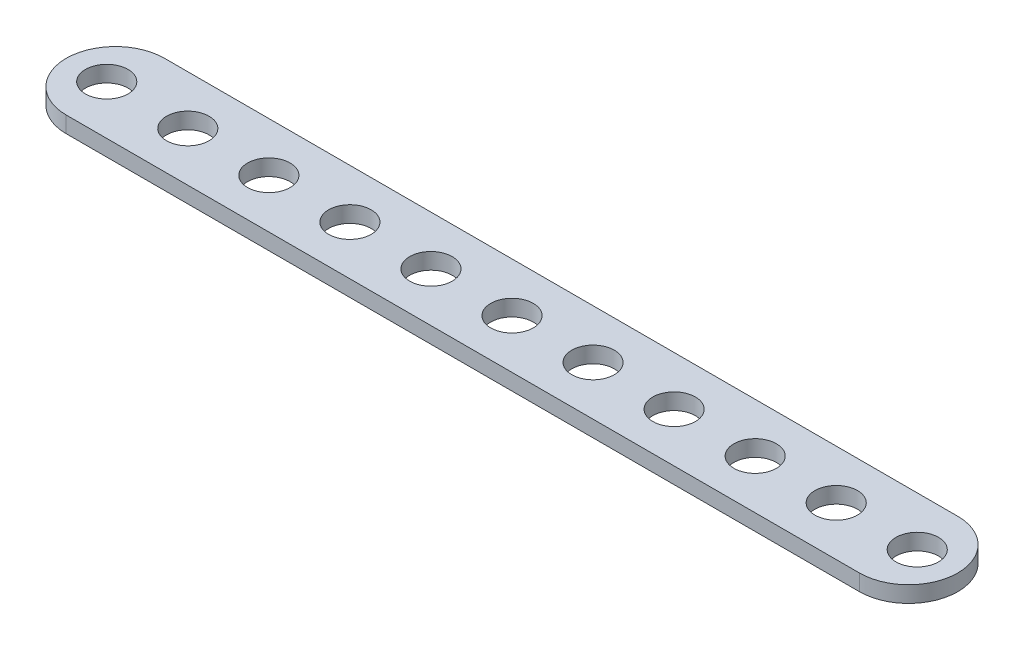
ISO-10303-21;
HEADER;
FILE_DESCRIPTION(('STEP AP214'),'2;1');
FILE_NAME('part.step','',(''),(''),'','','');
FILE_SCHEMA(('AUTOMOTIVE_DESIGN { 1 0 10303 214 1 1 1 1 }'));
ENDSEC;
DATA;
#1=APPLICATION_CONTEXT('core data for automotive mechanical design processes');
#2=APPLICATION_PROTOCOL_DEFINITION('international standard','automotive_design',2000,#1);
#3=PRODUCT_CONTEXT('',#1,'mechanical');
#4=PRODUCT('Part','Part','',(#3));
#5=PRODUCT_RELATED_PRODUCT_CATEGORY('part','',(#4));
#6=PRODUCT_DEFINITION_FORMATION('','',#4);
#7=PRODUCT_DEFINITION_CONTEXT('part definition',#1,'design');
#8=PRODUCT_DEFINITION('design','',#6,#7);
#9=PRODUCT_DEFINITION_SHAPE('','',#8);
#10=(LENGTH_UNIT() NAMED_UNIT(*) SI_UNIT(.MILLI.,.METRE.));
#11=(NAMED_UNIT(*) PLANE_ANGLE_UNIT() SI_UNIT($,.RADIAN.));
#12=(NAMED_UNIT(*) SI_UNIT($,.STERADIAN.) SOLID_ANGLE_UNIT());
#13=UNCERTAINTY_MEASURE_WITH_UNIT(LENGTH_MEASURE(1.E-05),#10,'distance_accuracy_value','');
#14=(GEOMETRIC_REPRESENTATION_CONTEXT(3) GLOBAL_UNCERTAINTY_ASSIGNED_CONTEXT((#13)) GLOBAL_UNIT_ASSIGNED_CONTEXT((#10,
#11,#12)) REPRESENTATION_CONTEXT('',''));
#15=CARTESIAN_POINT('',(0.,0.,0.));
#16=DIRECTION('',(0.,0.,1.));
#17=DIRECTION('',(1.,0.,0.));
#18=AXIS2_PLACEMENT_3D('',#15,#16,#17);
#19=CARTESIAN_POINT('',(4.85,1.6,0.));
#20=DIRECTION('',(0.,-1.,0.));
#21=DIRECTION('',(0.,0.,-1.));
#22=AXIS2_PLACEMENT_3D('',#19,#20,#21);
#23=CYLINDRICAL_SURFACE('',#22,4.85);
#24=CARTESIAN_POINT('',(4.85,0.,0.));
#25=DIRECTION('',(0.,1.,0.));
#26=DIRECTION('',(0.,0.,1.));
#27=AXIS2_PLACEMENT_3D('',#24,#25,#26);
#28=CIRCLE('',#27,4.85);
#29=CARTESIAN_POINT('',(4.85,0.,-4.85));
#30=VERTEX_POINT('',#29);
#31=CARTESIAN_POINT('',(4.85,0.,4.85));
#32=VERTEX_POINT('',#31);
#33=EDGE_CURVE('E95',#30,#32,#28,.T.);
#34=ORIENTED_EDGE('',*,*,#33,.T.);
#35=DIRECTION('',(0.,-1.,0.));
#36=VECTOR('',#35,1.);
#37=CARTESIAN_POINT('',(4.85,1.6,4.85));
#38=LINE('',#37,#36);
#39=CARTESIAN_POINT('',(4.85,1.6,4.85));
#40=VERTEX_POINT('',#39);
#41=EDGE_CURVE('E11',#40,#32,#38,.T.);
#42=ORIENTED_EDGE('',*,*,#41,.F.);
#43=CARTESIAN_POINT('',(4.85,1.6,0.));
#44=DIRECTION('',(0.,1.,0.));
#45=DIRECTION('',(0.,0.,1.));
#46=AXIS2_PLACEMENT_3D('',#43,#44,#45);
#47=CIRCLE('',#46,4.85);
#48=CARTESIAN_POINT('',(4.85,1.6,-4.85));
#49=VERTEX_POINT('',#48);
#50=EDGE_CURVE('E83',#49,#40,#47,.T.);
#51=ORIENTED_EDGE('',*,*,#50,.F.);
#52=DIRECTION('',(0.,-1.,0.));
#53=VECTOR('',#52,1.);
#54=CARTESIAN_POINT('',(4.85,1.6,-4.85));
#55=LINE('',#54,#53);
#56=EDGE_CURVE('E91',#49,#30,#55,.T.);
#57=ORIENTED_EDGE('',*,*,#56,.T.);
#58=EDGE_LOOP('',(#34,#42,#51,#57));
#59=FACE_BOUND('',#58,.T.);
#60=ADVANCED_FACE('F32',(#59),#23,.T.);
#61=CARTESIAN_POINT('',(4.85,1.6,4.85));
#62=DIRECTION('',(0.,0.,-1.));
#63=DIRECTION('',(-1.,0.,0.));
#64=AXIS2_PLACEMENT_3D('',#61,#62,#63);
#65=PLANE('',#64);
#66=DIRECTION('',(1.,0.,0.));
#67=VECTOR('',#66,1.);
#68=CARTESIAN_POINT('',(4.85,0.,4.85));
#69=LINE('',#68,#67);
#70=CARTESIAN_POINT('',(83.15,0.,4.85));
#71=VERTEX_POINT('',#70);
#72=EDGE_CURVE('E87',#32,#71,#69,.T.);
#73=ORIENTED_EDGE('',*,*,#72,.T.);
#74=DIRECTION('',(0.,-1.,0.));
#75=VECTOR('',#74,1.);
#76=CARTESIAN_POINT('',(83.15,1.6,4.85));
#77=LINE('',#76,#75);
#78=CARTESIAN_POINT('',(83.15,1.6,4.85));
#79=VERTEX_POINT('',#78);
#80=EDGE_CURVE('E40',#79,#71,#77,.T.);
#81=ORIENTED_EDGE('',*,*,#80,.F.);
#82=DIRECTION('',(1.,0.,0.));
#83=VECTOR('',#82,1.);
#84=CARTESIAN_POINT('',(4.85,1.6,4.85));
#85=LINE('',#84,#83);
#86=EDGE_CURVE('E78',#40,#79,#85,.T.);
#87=ORIENTED_EDGE('',*,*,#86,.F.);
#88=ORIENTED_EDGE('',*,*,#41,.T.);
#89=EDGE_LOOP('',(#73,#81,#87,#88));
#90=FACE_BOUND('',#89,.T.);
#91=ADVANCED_FACE('F86',(#90),#65,.F.);
#92=CARTESIAN_POINT('',(83.15,1.6,0.));
#93=DIRECTION('',(0.,-1.,0.));
#94=DIRECTION('',(0.,0.,-1.));
#95=AXIS2_PLACEMENT_3D('',#92,#93,#94);
#96=CYLINDRICAL_SURFACE('',#95,4.85);
#97=CARTESIAN_POINT('',(83.15,0.,0.));
#98=DIRECTION('',(0.,1.,0.));
#99=DIRECTION('',(0.,0.,1.));
#100=AXIS2_PLACEMENT_3D('',#97,#98,#99);
#101=CIRCLE('',#100,4.85);
#102=CARTESIAN_POINT('',(83.15,0.,-4.85));
#103=VERTEX_POINT('',#102);
#104=EDGE_CURVE('E65',#71,#103,#101,.T.);
#105=ORIENTED_EDGE('',*,*,#104,.T.);
#106=DIRECTION('',(0.,-1.,0.));
#107=VECTOR('',#106,1.);
#108=CARTESIAN_POINT('',(83.15,1.6,-4.85));
#109=LINE('',#108,#107);
#110=CARTESIAN_POINT('',(83.15,1.6,-4.85));
#111=VERTEX_POINT('',#110);
#112=EDGE_CURVE('E88',#111,#103,#109,.T.);
#113=ORIENTED_EDGE('',*,*,#112,.F.);
#114=CARTESIAN_POINT('',(83.15,1.6,0.));
#115=DIRECTION('',(0.,1.,0.));
#116=DIRECTION('',(0.,0.,1.));
#117=AXIS2_PLACEMENT_3D('',#114,#115,#116);
#118=CIRCLE('',#117,4.85);
#119=EDGE_CURVE('E81',#79,#111,#118,.T.);
#120=ORIENTED_EDGE('',*,*,#119,.F.);
#121=ORIENTED_EDGE('',*,*,#80,.T.);
#122=EDGE_LOOP('',(#105,#113,#120,#121));
#123=FACE_BOUND('',#122,.T.);
#124=ADVANCED_FACE('F89',(#123),#96,.T.);
#125=CARTESIAN_POINT('',(4.85,1.6,-4.85));
#126=DIRECTION('',(0.,0.,1.));
#127=DIRECTION('',(1.,0.,0.));
#128=AXIS2_PLACEMENT_3D('',#125,#126,#127);
#129=PLANE('',#128);
#130=DIRECTION('',(-1.,0.,0.));
#131=VECTOR('',#130,1.);
#132=CARTESIAN_POINT('',(4.85,0.,-4.85));
#133=LINE('',#132,#131);
#134=EDGE_CURVE('E71',#103,#30,#133,.T.);
#135=ORIENTED_EDGE('',*,*,#134,.T.);
#136=ORIENTED_EDGE('',*,*,#56,.F.);
#137=DIRECTION('',(-1.,0.,0.));
#138=VECTOR('',#137,1.);
#139=CARTESIAN_POINT('',(4.85,1.6,-4.85));
#140=LINE('',#139,#138);
#141=EDGE_CURVE('E48',#111,#49,#140,.T.);
#142=ORIENTED_EDGE('',*,*,#141,.F.);
#143=ORIENTED_EDGE('',*,*,#112,.T.);
#144=EDGE_LOOP('',(#135,#136,#142,#143));
#145=FACE_BOUND('',#144,.T.);
#146=ADVANCED_FACE('F103',(#145),#129,.F.);
#147=CARTESIAN_POINT('',(4.85,1.6,0.));
#148=DIRECTION('',(0.,1.,0.));
#149=DIRECTION('',(0.,0.,1.));
#150=AXIS2_PLACEMENT_3D('',#147,#148,#149);
#151=PLANE('',#150);
#152=CARTESIAN_POINT('',(84.,1.6,0.));
#153=DIRECTION('',(0.,1.,0.));
#154=DIRECTION('',(0.,0.,1.));
#155=AXIS2_PLACEMENT_3D('',#152,#153,#154);
#156=CIRCLE('',#155,2.1);
#157=CARTESIAN_POINT('',(84.,1.6,2.1));
#158=VERTEX_POINT('',#157);
#159=EDGE_CURVE('E169',#158,#158,#156,.T.);
#160=ORIENTED_EDGE('',*,*,#159,.F.);
#161=EDGE_LOOP('',(#160));
#162=FACE_BOUND('',#161,.T.);
#163=CARTESIAN_POINT('',(76.,1.6,0.));
#164=DIRECTION('',(0.,1.,0.));
#165=DIRECTION('',(0.,0.,1.));
#166=AXIS2_PLACEMENT_3D('',#163,#164,#165);
#167=CIRCLE('',#166,2.1);
#168=CARTESIAN_POINT('',(76.,1.6,2.1));
#169=VERTEX_POINT('',#168);
#170=EDGE_CURVE('E163',#169,#169,#167,.T.);
#171=ORIENTED_EDGE('',*,*,#170,.F.);
#172=EDGE_LOOP('',(#171));
#173=FACE_BOUND('',#172,.T.);
#174=CARTESIAN_POINT('',(68.,1.6,0.));
#175=DIRECTION('',(0.,1.,0.));
#176=DIRECTION('',(0.,0.,1.));
#177=AXIS2_PLACEMENT_3D('',#174,#175,#176);
#178=CIRCLE('',#177,2.1);
#179=CARTESIAN_POINT('',(68.,1.6,2.1));
#180=VERTEX_POINT('',#179);
#181=EDGE_CURVE('E157',#180,#180,#178,.T.);
#182=ORIENTED_EDGE('',*,*,#181,.F.);
#183=EDGE_LOOP('',(#182));
#184=FACE_BOUND('',#183,.T.);
#185=CARTESIAN_POINT('',(60.,1.6,0.));
#186=DIRECTION('',(0.,1.,0.));
#187=DIRECTION('',(0.,0.,1.));
#188=AXIS2_PLACEMENT_3D('',#185,#186,#187);
#189=CIRCLE('',#188,2.1);
#190=CARTESIAN_POINT('',(60.,1.6,2.1));
#191=VERTEX_POINT('',#190);
#192=EDGE_CURVE('E151',#191,#191,#189,.T.);
#193=ORIENTED_EDGE('',*,*,#192,.F.);
#194=EDGE_LOOP('',(#193));
#195=FACE_BOUND('',#194,.T.);
#196=CARTESIAN_POINT('',(52.,1.6,0.));
#197=DIRECTION('',(0.,1.,0.));
#198=DIRECTION('',(0.,0.,1.));
#199=AXIS2_PLACEMENT_3D('',#196,#197,#198);
#200=CIRCLE('',#199,2.1);
#201=CARTESIAN_POINT('',(52.,1.6,2.1));
#202=VERTEX_POINT('',#201);
#203=EDGE_CURVE('E145',#202,#202,#200,.T.);
#204=ORIENTED_EDGE('',*,*,#203,.F.);
#205=EDGE_LOOP('',(#204));
#206=FACE_BOUND('',#205,.T.);
#207=CARTESIAN_POINT('',(44.,1.6,0.));
#208=DIRECTION('',(0.,1.,0.));
#209=DIRECTION('',(0.,0.,1.));
#210=AXIS2_PLACEMENT_3D('',#207,#208,#209);
#211=CIRCLE('',#210,2.1);
#212=CARTESIAN_POINT('',(44.,1.6,2.1));
#213=VERTEX_POINT('',#212);
#214=EDGE_CURVE('E139',#213,#213,#211,.T.);
#215=ORIENTED_EDGE('',*,*,#214,.F.);
#216=EDGE_LOOP('',(#215));
#217=FACE_BOUND('',#216,.T.);
#218=CARTESIAN_POINT('',(36.,1.6,0.));
#219=DIRECTION('',(0.,1.,0.));
#220=DIRECTION('',(0.,0.,1.));
#221=AXIS2_PLACEMENT_3D('',#218,#219,#220);
#222=CIRCLE('',#221,2.1);
#223=CARTESIAN_POINT('',(36.,1.6,2.1));
#224=VERTEX_POINT('',#223);
#225=EDGE_CURVE('E133',#224,#224,#222,.T.);
#226=ORIENTED_EDGE('',*,*,#225,.F.);
#227=EDGE_LOOP('',(#226));
#228=FACE_BOUND('',#227,.T.);
#229=CARTESIAN_POINT('',(28.,1.6,0.));
#230=DIRECTION('',(0.,1.,0.));
#231=DIRECTION('',(0.,0.,1.));
#232=AXIS2_PLACEMENT_3D('',#229,#230,#231);
#233=CIRCLE('',#232,2.1);
#234=CARTESIAN_POINT('',(28.,1.6,2.1));
#235=VERTEX_POINT('',#234);
#236=EDGE_CURVE('E127',#235,#235,#233,.T.);
#237=ORIENTED_EDGE('',*,*,#236,.F.);
#238=EDGE_LOOP('',(#237));
#239=FACE_BOUND('',#238,.T.);
#240=CARTESIAN_POINT('',(20.,1.6,0.));
#241=DIRECTION('',(0.,1.,0.));
#242=DIRECTION('',(0.,0.,1.));
#243=AXIS2_PLACEMENT_3D('',#240,#241,#242);
#244=CIRCLE('',#243,2.1);
#245=CARTESIAN_POINT('',(20.,1.6,2.1));
#246=VERTEX_POINT('',#245);
#247=EDGE_CURVE('E121',#246,#246,#244,.T.);
#248=ORIENTED_EDGE('',*,*,#247,.F.);
#249=EDGE_LOOP('',(#248));
#250=FACE_BOUND('',#249,.T.);
#251=CARTESIAN_POINT('',(12.,1.6,0.));
#252=DIRECTION('',(0.,1.,0.));
#253=DIRECTION('',(0.,0.,1.));
#254=AXIS2_PLACEMENT_3D('',#251,#252,#253);
#255=CIRCLE('',#254,2.1);
#256=CARTESIAN_POINT('',(12.,1.6,2.1));
#257=VERTEX_POINT('',#256);
#258=EDGE_CURVE('E115',#257,#257,#255,.T.);
#259=ORIENTED_EDGE('',*,*,#258,.F.);
#260=EDGE_LOOP('',(#259));
#261=FACE_BOUND('',#260,.T.);
#262=CARTESIAN_POINT('',(4.,1.6,0.));
#263=DIRECTION('',(0.,1.,0.));
#264=DIRECTION('',(0.,0.,1.));
#265=AXIS2_PLACEMENT_3D('',#262,#263,#264);
#266=CIRCLE('',#265,2.1);
#267=CARTESIAN_POINT('',(4.,1.6,2.1));
#268=VERTEX_POINT('',#267);
#269=EDGE_CURVE('E109',#268,#268,#266,.T.);
#270=ORIENTED_EDGE('',*,*,#269,.F.);
#271=EDGE_LOOP('',(#270));
#272=FACE_BOUND('',#271,.T.);
#273=ORIENTED_EDGE('',*,*,#50,.T.);
#274=ORIENTED_EDGE('',*,*,#86,.T.);
#275=ORIENTED_EDGE('',*,*,#119,.T.);
#276=ORIENTED_EDGE('',*,*,#141,.T.);
#277=EDGE_LOOP('',(#273,#274,#275,#276));
#278=FACE_BOUND('',#277,.T.);
#279=ADVANCED_FACE('F79',(#162,#173,#184,#195,#206,#217,#228,#239,#250,#261,#272,#278),#151,.T.);
#280=CARTESIAN_POINT('',(4.85,0.,0.));
#281=DIRECTION('',(0.,1.,0.));
#282=DIRECTION('',(0.,0.,1.));
#283=AXIS2_PLACEMENT_3D('',#280,#281,#282);
#284=PLANE('',#283);
#285=CARTESIAN_POINT('',(84.,0.,0.));
#286=DIRECTION('',(0.,1.,0.));
#287=DIRECTION('',(0.,0.,1.));
#288=AXIS2_PLACEMENT_3D('',#285,#286,#287);
#289=CIRCLE('',#288,2.1);
#290=CARTESIAN_POINT('',(84.,0.,2.1));
#291=VERTEX_POINT('',#290);
#292=EDGE_CURVE('E166',#291,#291,#289,.T.);
#293=ORIENTED_EDGE('',*,*,#292,.T.);
#294=EDGE_LOOP('',(#293));
#295=FACE_BOUND('',#294,.T.);
#296=CARTESIAN_POINT('',(76.,0.,0.));
#297=DIRECTION('',(0.,1.,0.));
#298=DIRECTION('',(0.,0.,1.));
#299=AXIS2_PLACEMENT_3D('',#296,#297,#298);
#300=CIRCLE('',#299,2.1);
#301=CARTESIAN_POINT('',(76.,0.,2.1));
#302=VERTEX_POINT('',#301);
#303=EDGE_CURVE('E160',#302,#302,#300,.T.);
#304=ORIENTED_EDGE('',*,*,#303,.T.);
#305=EDGE_LOOP('',(#304));
#306=FACE_BOUND('',#305,.T.);
#307=CARTESIAN_POINT('',(68.,0.,0.));
#308=DIRECTION('',(0.,1.,0.));
#309=DIRECTION('',(0.,0.,1.));
#310=AXIS2_PLACEMENT_3D('',#307,#308,#309);
#311=CIRCLE('',#310,2.1);
#312=CARTESIAN_POINT('',(68.,0.,2.1));
#313=VERTEX_POINT('',#312);
#314=EDGE_CURVE('E154',#313,#313,#311,.T.);
#315=ORIENTED_EDGE('',*,*,#314,.T.);
#316=EDGE_LOOP('',(#315));
#317=FACE_BOUND('',#316,.T.);
#318=CARTESIAN_POINT('',(60.,0.,0.));
#319=DIRECTION('',(0.,1.,0.));
#320=DIRECTION('',(0.,0.,1.));
#321=AXIS2_PLACEMENT_3D('',#318,#319,#320);
#322=CIRCLE('',#321,2.1);
#323=CARTESIAN_POINT('',(60.,0.,2.1));
#324=VERTEX_POINT('',#323);
#325=EDGE_CURVE('E148',#324,#324,#322,.T.);
#326=ORIENTED_EDGE('',*,*,#325,.T.);
#327=EDGE_LOOP('',(#326));
#328=FACE_BOUND('',#327,.T.);
#329=CARTESIAN_POINT('',(52.,0.,0.));
#330=DIRECTION('',(0.,1.,0.));
#331=DIRECTION('',(0.,0.,1.));
#332=AXIS2_PLACEMENT_3D('',#329,#330,#331);
#333=CIRCLE('',#332,2.1);
#334=CARTESIAN_POINT('',(52.,0.,2.1));
#335=VERTEX_POINT('',#334);
#336=EDGE_CURVE('E142',#335,#335,#333,.T.);
#337=ORIENTED_EDGE('',*,*,#336,.T.);
#338=EDGE_LOOP('',(#337));
#339=FACE_BOUND('',#338,.T.);
#340=CARTESIAN_POINT('',(44.,0.,0.));
#341=DIRECTION('',(0.,1.,0.));
#342=DIRECTION('',(0.,0.,1.));
#343=AXIS2_PLACEMENT_3D('',#340,#341,#342);
#344=CIRCLE('',#343,2.1);
#345=CARTESIAN_POINT('',(44.,0.,2.1));
#346=VERTEX_POINT('',#345);
#347=EDGE_CURVE('E136',#346,#346,#344,.T.);
#348=ORIENTED_EDGE('',*,*,#347,.T.);
#349=EDGE_LOOP('',(#348));
#350=FACE_BOUND('',#349,.T.);
#351=CARTESIAN_POINT('',(36.,0.,0.));
#352=DIRECTION('',(0.,1.,0.));
#353=DIRECTION('',(0.,0.,1.));
#354=AXIS2_PLACEMENT_3D('',#351,#352,#353);
#355=CIRCLE('',#354,2.1);
#356=CARTESIAN_POINT('',(36.,0.,2.1));
#357=VERTEX_POINT('',#356);
#358=EDGE_CURVE('E130',#357,#357,#355,.T.);
#359=ORIENTED_EDGE('',*,*,#358,.T.);
#360=EDGE_LOOP('',(#359));
#361=FACE_BOUND('',#360,.T.);
#362=CARTESIAN_POINT('',(28.,0.,0.));
#363=DIRECTION('',(0.,1.,0.));
#364=DIRECTION('',(0.,0.,1.));
#365=AXIS2_PLACEMENT_3D('',#362,#363,#364);
#366=CIRCLE('',#365,2.1);
#367=CARTESIAN_POINT('',(28.,0.,2.1));
#368=VERTEX_POINT('',#367);
#369=EDGE_CURVE('E124',#368,#368,#366,.T.);
#370=ORIENTED_EDGE('',*,*,#369,.T.);
#371=EDGE_LOOP('',(#370));
#372=FACE_BOUND('',#371,.T.);
#373=CARTESIAN_POINT('',(20.,0.,0.));
#374=DIRECTION('',(0.,1.,0.));
#375=DIRECTION('',(0.,0.,1.));
#376=AXIS2_PLACEMENT_3D('',#373,#374,#375);
#377=CIRCLE('',#376,2.1);
#378=CARTESIAN_POINT('',(20.,0.,2.1));
#379=VERTEX_POINT('',#378);
#380=EDGE_CURVE('E118',#379,#379,#377,.T.);
#381=ORIENTED_EDGE('',*,*,#380,.T.);
#382=EDGE_LOOP('',(#381));
#383=FACE_BOUND('',#382,.T.);
#384=CARTESIAN_POINT('',(12.,0.,0.));
#385=DIRECTION('',(0.,1.,0.));
#386=DIRECTION('',(0.,0.,1.));
#387=AXIS2_PLACEMENT_3D('',#384,#385,#386);
#388=CIRCLE('',#387,2.1);
#389=CARTESIAN_POINT('',(12.,0.,2.1));
#390=VERTEX_POINT('',#389);
#391=EDGE_CURVE('E112',#390,#390,#388,.T.);
#392=ORIENTED_EDGE('',*,*,#391,.T.);
#393=EDGE_LOOP('',(#392));
#394=FACE_BOUND('',#393,.T.);
#395=CARTESIAN_POINT('',(4.,0.,0.));
#396=DIRECTION('',(0.,1.,0.));
#397=DIRECTION('',(0.,0.,1.));
#398=AXIS2_PLACEMENT_3D('',#395,#396,#397);
#399=CIRCLE('',#398,2.1);
#400=CARTESIAN_POINT('',(4.,0.,2.1));
#401=VERTEX_POINT('',#400);
#402=EDGE_CURVE('E98',#401,#401,#399,.T.);
#403=ORIENTED_EDGE('',*,*,#402,.T.);
#404=EDGE_LOOP('',(#403));
#405=FACE_BOUND('',#404,.T.);
#406=ORIENTED_EDGE('',*,*,#33,.F.);
#407=ORIENTED_EDGE('',*,*,#134,.F.);
#408=ORIENTED_EDGE('',*,*,#104,.F.);
#409=ORIENTED_EDGE('',*,*,#72,.F.);
#410=EDGE_LOOP('',(#406,#407,#408,#409));
#411=FACE_BOUND('',#410,.T.);
#412=ADVANCED_FACE('F106',(#295,#306,#317,#328,#339,#350,#361,#372,#383,#394,#405,#411),#284,.F.);
#413=CARTESIAN_POINT('',(4.,0.,0.));
#414=DIRECTION('',(0.,1.,0.));
#415=DIRECTION('',(0.,0.,1.));
#416=AXIS2_PLACEMENT_3D('',#413,#414,#415);
#417=CYLINDRICAL_SURFACE('',#416,2.1);
#418=ORIENTED_EDGE('',*,*,#402,.F.);
#419=EDGE_LOOP('',(#418));
#420=FACE_BOUND('',#419,.T.);
#421=ORIENTED_EDGE('',*,*,#269,.T.);
#422=EDGE_LOOP('',(#421));
#423=FACE_BOUND('',#422,.T.);
#424=ADVANCED_FACE('F207',(#420,#423),#417,.F.);
#425=CARTESIAN_POINT('',(12.,0.,0.));
#426=DIRECTION('',(0.,1.,0.));
#427=DIRECTION('',(0.,0.,1.));
#428=AXIS2_PLACEMENT_3D('',#425,#426,#427);
#429=CYLINDRICAL_SURFACE('',#428,2.1);
#430=ORIENTED_EDGE('',*,*,#391,.F.);
#431=EDGE_LOOP('',(#430));
#432=FACE_BOUND('',#431,.T.);
#433=ORIENTED_EDGE('',*,*,#258,.T.);
#434=EDGE_LOOP('',(#433));
#435=FACE_BOUND('',#434,.T.);
#436=ADVANCED_FACE('F209',(#432,#435),#429,.F.);
#437=CARTESIAN_POINT('',(20.,0.,0.));
#438=DIRECTION('',(0.,1.,0.));
#439=DIRECTION('',(0.,0.,1.));
#440=AXIS2_PLACEMENT_3D('',#437,#438,#439);
#441=CYLINDRICAL_SURFACE('',#440,2.1);
#442=ORIENTED_EDGE('',*,*,#380,.F.);
#443=EDGE_LOOP('',(#442));
#444=FACE_BOUND('',#443,.T.);
#445=ORIENTED_EDGE('',*,*,#247,.T.);
#446=EDGE_LOOP('',(#445));
#447=FACE_BOUND('',#446,.T.);
#448=ADVANCED_FACE('F216',(#444,#447),#441,.F.);
#449=CARTESIAN_POINT('',(28.,0.,0.));
#450=DIRECTION('',(0.,1.,0.));
#451=DIRECTION('',(0.,0.,1.));
#452=AXIS2_PLACEMENT_3D('',#449,#450,#451);
#453=CYLINDRICAL_SURFACE('',#452,2.1);
#454=ORIENTED_EDGE('',*,*,#369,.F.);
#455=EDGE_LOOP('',(#454));
#456=FACE_BOUND('',#455,.T.);
#457=ORIENTED_EDGE('',*,*,#236,.T.);
#458=EDGE_LOOP('',(#457));
#459=FACE_BOUND('',#458,.T.);
#460=ADVANCED_FACE('F259',(#456,#459),#453,.F.);
#461=CARTESIAN_POINT('',(36.,0.,0.));
#462=DIRECTION('',(0.,1.,0.));
#463=DIRECTION('',(0.,0.,1.));
#464=AXIS2_PLACEMENT_3D('',#461,#462,#463);
#465=CYLINDRICAL_SURFACE('',#464,2.1);
#466=ORIENTED_EDGE('',*,*,#358,.F.);
#467=EDGE_LOOP('',(#466));
#468=FACE_BOUND('',#467,.T.);
#469=ORIENTED_EDGE('',*,*,#225,.T.);
#470=EDGE_LOOP('',(#469));
#471=FACE_BOUND('',#470,.T.);
#472=ADVANCED_FACE('F269',(#468,#471),#465,.F.);
#473=CARTESIAN_POINT('',(44.,0.,0.));
#474=DIRECTION('',(0.,1.,0.));
#475=DIRECTION('',(0.,0.,1.));
#476=AXIS2_PLACEMENT_3D('',#473,#474,#475);
#477=CYLINDRICAL_SURFACE('',#476,2.1);
#478=ORIENTED_EDGE('',*,*,#347,.F.);
#479=EDGE_LOOP('',(#478));
#480=FACE_BOUND('',#479,.T.);
#481=ORIENTED_EDGE('',*,*,#214,.T.);
#482=EDGE_LOOP('',(#481));
#483=FACE_BOUND('',#482,.T.);
#484=ADVANCED_FACE('F279',(#480,#483),#477,.F.);
#485=CARTESIAN_POINT('',(52.,0.,0.));
#486=DIRECTION('',(0.,1.,0.));
#487=DIRECTION('',(0.,0.,1.));
#488=AXIS2_PLACEMENT_3D('',#485,#486,#487);
#489=CYLINDRICAL_SURFACE('',#488,2.1);
#490=ORIENTED_EDGE('',*,*,#336,.F.);
#491=EDGE_LOOP('',(#490));
#492=FACE_BOUND('',#491,.T.);
#493=ORIENTED_EDGE('',*,*,#203,.T.);
#494=EDGE_LOOP('',(#493));
#495=FACE_BOUND('',#494,.T.);
#496=ADVANCED_FACE('F289',(#492,#495),#489,.F.);
#497=CARTESIAN_POINT('',(60.,0.,0.));
#498=DIRECTION('',(0.,1.,0.));
#499=DIRECTION('',(0.,0.,1.));
#500=AXIS2_PLACEMENT_3D('',#497,#498,#499);
#501=CYLINDRICAL_SURFACE('',#500,2.1);
#502=ORIENTED_EDGE('',*,*,#325,.F.);
#503=EDGE_LOOP('',(#502));
#504=FACE_BOUND('',#503,.T.);
#505=ORIENTED_EDGE('',*,*,#192,.T.);
#506=EDGE_LOOP('',(#505));
#507=FACE_BOUND('',#506,.T.);
#508=ADVANCED_FACE('F299',(#504,#507),#501,.F.);
#509=CARTESIAN_POINT('',(68.,0.,0.));
#510=DIRECTION('',(0.,1.,0.));
#511=DIRECTION('',(0.,0.,1.));
#512=AXIS2_PLACEMENT_3D('',#509,#510,#511);
#513=CYLINDRICAL_SURFACE('',#512,2.1);
#514=ORIENTED_EDGE('',*,*,#314,.F.);
#515=EDGE_LOOP('',(#514));
#516=FACE_BOUND('',#515,.T.);
#517=ORIENTED_EDGE('',*,*,#181,.T.);
#518=EDGE_LOOP('',(#517));
#519=FACE_BOUND('',#518,.T.);
#520=ADVANCED_FACE('F309',(#516,#519),#513,.F.);
#521=CARTESIAN_POINT('',(76.,0.,0.));
#522=DIRECTION('',(0.,1.,0.));
#523=DIRECTION('',(0.,0.,1.));
#524=AXIS2_PLACEMENT_3D('',#521,#522,#523);
#525=CYLINDRICAL_SURFACE('',#524,2.1);
#526=ORIENTED_EDGE('',*,*,#303,.F.);
#527=EDGE_LOOP('',(#526));
#528=FACE_BOUND('',#527,.T.);
#529=ORIENTED_EDGE('',*,*,#170,.T.);
#530=EDGE_LOOP('',(#529));
#531=FACE_BOUND('',#530,.T.);
#532=ADVANCED_FACE('F180',(#528,#531),#525,.F.);
#533=CARTESIAN_POINT('',(84.,0.,0.));
#534=DIRECTION('',(0.,1.,0.));
#535=DIRECTION('',(0.,0.,1.));
#536=AXIS2_PLACEMENT_3D('',#533,#534,#535);
#537=CYLINDRICAL_SURFACE('',#536,2.1);
#538=ORIENTED_EDGE('',*,*,#292,.F.);
#539=EDGE_LOOP('',(#538));
#540=FACE_BOUND('',#539,.T.);
#541=ORIENTED_EDGE('',*,*,#159,.T.);
#542=EDGE_LOOP('',(#541));
#543=FACE_BOUND('',#542,.T.);
#544=ADVANCED_FACE('F177',(#540,#543),#537,.F.);
#545=CLOSED_SHELL('',(#60,#91,#124,#146,#279,#412,#424,#436,#448,#460,#472,#484,#496,#508,#520,
#532,#544));
#546=MANIFOLD_SOLID_BREP('B2',#545);
#547=ADVANCED_BREP_SHAPE_REPRESENTATION('',(#18,#546),#14);
#548=SHAPE_DEFINITION_REPRESENTATION(#9,#547);
ENDSEC;
END-ISO-10303-21;
